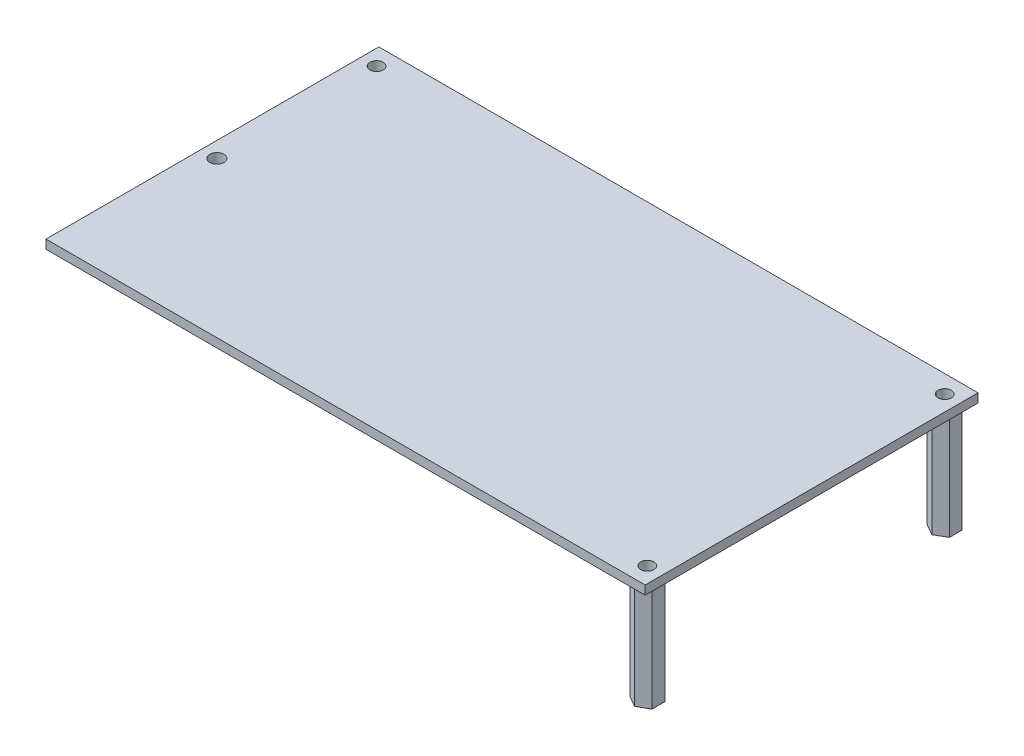
ISO-10303-21;
HEADER;
FILE_DESCRIPTION(('STEP AP214'),'2;1');
FILE_NAME('part.step','',(''),(''),'','','');
FILE_SCHEMA(('AUTOMOTIVE_DESIGN { 1 0 10303 214 1 1 1 1 }'));
ENDSEC;
DATA;
#1=APPLICATION_CONTEXT('core data for automotive mechanical design processes');
#2=APPLICATION_PROTOCOL_DEFINITION('international standard','automotive_design',2000,#1);
#3=PRODUCT_CONTEXT('',#1,'mechanical');
#4=PRODUCT('Part','Part','',(#3));
#5=PRODUCT_RELATED_PRODUCT_CATEGORY('part','',(#4));
#6=PRODUCT_DEFINITION_FORMATION('','',#4);
#7=PRODUCT_DEFINITION_CONTEXT('part definition',#1,'design');
#8=PRODUCT_DEFINITION('design','',#6,#7);
#9=PRODUCT_DEFINITION_SHAPE('','',#8);
#10=(LENGTH_UNIT() NAMED_UNIT(*) SI_UNIT(.MILLI.,.METRE.));
#11=(NAMED_UNIT(*) PLANE_ANGLE_UNIT() SI_UNIT($,.RADIAN.));
#12=(NAMED_UNIT(*) SI_UNIT($,.STERADIAN.) SOLID_ANGLE_UNIT());
#13=UNCERTAINTY_MEASURE_WITH_UNIT(LENGTH_MEASURE(1.E-05),#10,'distance_accuracy_value','');
#14=(GEOMETRIC_REPRESENTATION_CONTEXT(3) GLOBAL_UNCERTAINTY_ASSIGNED_CONTEXT((#13)) GLOBAL_UNIT_ASSIGNED_CONTEXT((#10,
#11,#12)) REPRESENTATION_CONTEXT('',''));
#15=CARTESIAN_POINT('',(0.,0.,0.));
#16=DIRECTION('',(0.,0.,1.));
#17=DIRECTION('',(1.,0.,0.));
#18=AXIS2_PLACEMENT_3D('',#15,#16,#17);
#19=CARTESIAN_POINT('',(0.,0.,0.));
#20=DIRECTION('',(0.,-1.,0.));
#21=DIRECTION('',(0.,0.,-1.));
#22=AXIS2_PLACEMENT_3D('',#19,#20,#21);
#23=PLANE('',#22);
#24=DIRECTION('',(0.866025403784531,0.,0.499999999999841));
#25=VECTOR('',#24,1.);
#26=CARTESIAN_POINT('',(131.5,0.,-6.88675134594749));
#27=LINE('',#26,#25);
#28=CARTESIAN_POINT('',(131.5,0.,-6.88675134594749));
#29=VERTEX_POINT('',#28);
#30=CARTESIAN_POINT('',(134.,0.,-5.44337567297402));
#31=VERTEX_POINT('',#30);
#32=EDGE_CURVE('E249',#29,#31,#27,.T.);
#33=ORIENTED_EDGE('',*,*,#32,.F.);
#34=DIRECTION('',(0.866025403784541,0.,-0.499999999999823));
#35=VECTOR('',#34,1.);
#36=CARTESIAN_POINT('',(129.,0.,-5.4433756729741));
#37=LINE('',#36,#35);
#38=CARTESIAN_POINT('',(129.,0.,-5.4433756729741));
#39=VERTEX_POINT('',#38);
#40=EDGE_CURVE('E246',#39,#29,#37,.T.);
#41=ORIENTED_EDGE('',*,*,#40,.F.);
#42=DIRECTION('',(0.,0.,-1.));
#43=VECTOR('',#42,1.);
#44=CARTESIAN_POINT('',(129.,0.,-2.55662432702534));
#45=LINE('',#44,#43);
#46=CARTESIAN_POINT('',(129.,0.,-2.55662432702534));
#47=VERTEX_POINT('',#46);
#48=EDGE_CURVE('E259',#47,#39,#45,.T.);
#49=ORIENTED_EDGE('',*,*,#48,.F.);
#50=DIRECTION('',(-0.866025403784436,0.,-0.500000000000004));
#51=VECTOR('',#50,1.);
#52=CARTESIAN_POINT('',(131.5,0.,-1.11324865405125));
#53=LINE('',#52,#51);
#54=CARTESIAN_POINT('',(131.5,0.,-1.11324865405125));
#55=VERTEX_POINT('',#54);
#56=EDGE_CURVE('E275',#55,#47,#53,.T.);
#57=ORIENTED_EDGE('',*,*,#56,.F.);
#58=DIRECTION('',(-0.866025403784441,0.,0.499999999999995));
#59=VECTOR('',#58,1.);
#60=CARTESIAN_POINT('',(134.,0.,-2.55662432702529));
#61=LINE('',#60,#59);
#62=CARTESIAN_POINT('',(134.,0.,-2.55662432702529));
#63=VERTEX_POINT('',#62);
#64=EDGE_CURVE('E273',#63,#55,#61,.T.);
#65=ORIENTED_EDGE('',*,*,#64,.F.);
#66=DIRECTION('',(0.,0.,1.));
#67=VECTOR('',#66,1.);
#68=CARTESIAN_POINT('',(134.,0.,-5.44337567297402));
#69=LINE('',#68,#67);
#70=EDGE_CURVE('E271',#31,#63,#69,.T.);
#71=ORIENTED_EDGE('',*,*,#70,.F.);
#72=EDGE_LOOP('',(#33,#41,#49,#57,#65,#71));
#73=FACE_BOUND('',#72,.T.);
#74=DIRECTION('',(0.866025403784439,0.,0.499999999999999));
#75=VECTOR('',#74,1.);
#76=CARTESIAN_POINT('',(3.50000000000001,0.,-37.8867513459481));
#77=LINE('',#76,#75);
#78=CARTESIAN_POINT('',(3.50000000000001,0.,-37.8867513459481));
#79=VERTEX_POINT('',#78);
#80=CARTESIAN_POINT('',(6.00000000000001,0.,-36.4433756729741));
#81=VERTEX_POINT('',#80);
#82=EDGE_CURVE('E353',#79,#81,#77,.T.);
#83=ORIENTED_EDGE('',*,*,#82,.F.);
#84=DIRECTION('',(0.866025403784438,0.,-0.500000000000002));
#85=VECTOR('',#84,1.);
#86=CARTESIAN_POINT('',(1.00000000000001,0.,-36.4433756729741));
#87=LINE('',#86,#85);
#88=CARTESIAN_POINT('',(1.00000000000001,0.,-36.4433756729741));
#89=VERTEX_POINT('',#88);
#90=EDGE_CURVE('E335',#89,#79,#87,.T.);
#91=ORIENTED_EDGE('',*,*,#90,.F.);
#92=DIRECTION('',(0.,0.,-1.));
#93=VECTOR('',#92,1.);
#94=CARTESIAN_POINT('',(1.00000000000001,0.,-33.5566243270259));
#95=LINE('',#94,#93);
#96=CARTESIAN_POINT('',(1.00000000000001,0.,-33.5566243270259));
#97=VERTEX_POINT('',#96);
#98=EDGE_CURVE('E340',#97,#89,#95,.T.);
#99=ORIENTED_EDGE('',*,*,#98,.F.);
#100=DIRECTION('',(-0.86602540378444,0.,-0.499999999999998));
#101=VECTOR('',#100,1.);
#102=CARTESIAN_POINT('',(3.50000000000001,0.,-32.1132486540519));
#103=LINE('',#102,#101);
#104=CARTESIAN_POINT('',(3.50000000000001,0.,-32.1132486540519));
#105=VERTEX_POINT('',#104);
#106=EDGE_CURVE('E359',#105,#97,#103,.T.);
#107=ORIENTED_EDGE('',*,*,#106,.F.);
#108=DIRECTION('',(-0.866025403784439,0.,0.5));
#109=VECTOR('',#108,1.);
#110=CARTESIAN_POINT('',(6.00000000000001,0.,-33.5566243270259));
#111=LINE('',#110,#109);
#112=CARTESIAN_POINT('',(6.00000000000001,0.,-33.5566243270259));
#113=VERTEX_POINT('',#112);
#114=EDGE_CURVE('E357',#113,#105,#111,.T.);
#115=ORIENTED_EDGE('',*,*,#114,.F.);
#116=DIRECTION('',(0.,0.,1.));
#117=VECTOR('',#116,1.);
#118=CARTESIAN_POINT('',(6.00000000000001,0.,-36.4433756729741));
#119=LINE('',#118,#117);
#120=EDGE_CURVE('E355',#81,#113,#119,.T.);
#121=ORIENTED_EDGE('',*,*,#120,.F.);
#122=EDGE_LOOP('',(#83,#91,#99,#107,#115,#121));
#123=FACE_BOUND('',#122,.T.);
#124=DIRECTION('',(0.,0.,1.));
#125=VECTOR('',#124,1.);
#126=CARTESIAN_POINT('',(0.,0.,0.));
#127=LINE('',#126,#125);
#128=CARTESIAN_POINT('',(0.,0.,-75.));
#129=VERTEX_POINT('',#128);
#130=CARTESIAN_POINT('',(0.,0.,0.));
#131=VERTEX_POINT('',#130);
#132=EDGE_CURVE('E390',#129,#131,#127,.T.);
#133=ORIENTED_EDGE('',*,*,#132,.F.);
#134=DIRECTION('',(-1.,0.,0.));
#135=VECTOR('',#134,1.);
#136=CARTESIAN_POINT('',(0.,0.,-75.));
#137=LINE('',#136,#135);
#138=CARTESIAN_POINT('',(135.,0.,-75.));
#139=VERTEX_POINT('',#138);
#140=EDGE_CURVE('E395',#139,#129,#137,.T.);
#141=ORIENTED_EDGE('',*,*,#140,.F.);
#142=DIRECTION('',(0.,0.,-1.));
#143=VECTOR('',#142,1.);
#144=CARTESIAN_POINT('',(135.,0.,0.));
#145=LINE('',#144,#143);
#146=CARTESIAN_POINT('',(135.,0.,0.));
#147=VERTEX_POINT('',#146);
#148=EDGE_CURVE('E406',#147,#139,#145,.T.);
#149=ORIENTED_EDGE('',*,*,#148,.F.);
#150=DIRECTION('',(1.,0.,0.));
#151=VECTOR('',#150,1.);
#152=CARTESIAN_POINT('',(0.,0.,0.));
#153=LINE('',#152,#151);
#154=EDGE_CURVE('E404',#131,#147,#153,.T.);
#155=ORIENTED_EDGE('',*,*,#154,.F.);
#156=EDGE_LOOP('',(#133,#141,#149,#155));
#157=FACE_BOUND('',#156,.T.);
#158=DIRECTION('',(0.866025403784439,0.,0.5));
#159=VECTOR('',#158,1.);
#160=CARTESIAN_POINT('',(3.5,0.,-73.8867513459482));
#161=LINE('',#160,#159);
#162=CARTESIAN_POINT('',(3.5,0.,-73.8867513459482));
#163=VERTEX_POINT('',#162);
#164=CARTESIAN_POINT('',(6.00000000000002,0.,-72.4433756729741));
#165=VERTEX_POINT('',#164);
#166=EDGE_CURVE('E310',#163,#165,#161,.T.);
#167=ORIENTED_EDGE('',*,*,#166,.F.);
#168=DIRECTION('',(0.866025403784429,0.,-0.500000000000017));
#169=VECTOR('',#168,1.);
#170=CARTESIAN_POINT('',(1.00000000000002,0.,-72.4433756729741));
#171=LINE('',#170,#169);
#172=CARTESIAN_POINT('',(1.00000000000002,0.,-72.4433756729741));
#173=VERTEX_POINT('',#172);
#174=EDGE_CURVE('E292',#173,#163,#171,.T.);
#175=ORIENTED_EDGE('',*,*,#174,.F.);
#176=DIRECTION('',(0.,0.,-1.));
#177=VECTOR('',#176,1.);
#178=CARTESIAN_POINT('',(1.00000000000002,0.,-69.5566243270259));
#179=LINE('',#178,#177);
#180=CARTESIAN_POINT('',(1.00000000000002,0.,-69.5566243270259));
#181=VERTEX_POINT('',#180);
#182=EDGE_CURVE('E297',#181,#173,#179,.T.);
#183=ORIENTED_EDGE('',*,*,#182,.F.);
#184=DIRECTION('',(-0.866025403784439,0.,-0.499999999999999));
#185=VECTOR('',#184,1.);
#186=CARTESIAN_POINT('',(3.5,0.,-68.1132486540519));
#187=LINE('',#186,#185);
#188=CARTESIAN_POINT('',(3.5,0.,-68.1132486540519));
#189=VERTEX_POINT('',#188);
#190=EDGE_CURVE('E316',#189,#181,#187,.T.);
#191=ORIENTED_EDGE('',*,*,#190,.F.);
#192=DIRECTION('',(-0.866025403784439,0.,0.5));
#193=VECTOR('',#192,1.);
#194=CARTESIAN_POINT('',(6.00000000000002,0.,-69.5566243270259));
#195=LINE('',#194,#193);
#196=CARTESIAN_POINT('',(6.00000000000002,0.,-69.5566243270259));
#197=VERTEX_POINT('',#196);
#198=EDGE_CURVE('E314',#197,#189,#195,.T.);
#199=ORIENTED_EDGE('',*,*,#198,.F.);
#200=DIRECTION('',(0.,0.,1.));
#201=VECTOR('',#200,1.);
#202=CARTESIAN_POINT('',(6.00000000000002,0.,-72.4433756729741));
#203=LINE('',#202,#201);
#204=EDGE_CURVE('E312',#165,#197,#203,.T.);
#205=ORIENTED_EDGE('',*,*,#204,.F.);
#206=EDGE_LOOP('',(#167,#175,#183,#191,#199,#205));
#207=FACE_BOUND('',#206,.T.);
#208=DIRECTION('',(0.866025403784437,0.,-0.500000000000003));
#209=VECTOR('',#208,1.);
#210=CARTESIAN_POINT('',(129.,0.,-72.4433756729741));
#211=LINE('',#210,#209);
#212=CARTESIAN_POINT('',(129.,0.,-72.4433756729741));
#213=VERTEX_POINT('',#212);
#214=CARTESIAN_POINT('',(131.5,0.,-73.8867513459481));
#215=VERTEX_POINT('',#214);
#216=EDGE_CURVE('E604',#213,#215,#211,.T.);
#217=ORIENTED_EDGE('',*,*,#216,.F.);
#218=DIRECTION('',(0.,0.,-1.));
#219=VECTOR('',#218,1.);
#220=CARTESIAN_POINT('',(129.,0.,-69.556624327026));
#221=LINE('',#220,#219);
#222=CARTESIAN_POINT('',(129.,0.,-69.556624327026));
#223=VERTEX_POINT('',#222);
#224=EDGE_CURVE('E244',#223,#213,#221,.T.);
#225=ORIENTED_EDGE('',*,*,#224,.F.);
#226=DIRECTION('',(-0.866025403784437,0.,-0.500000000000003));
#227=VECTOR('',#226,1.);
#228=CARTESIAN_POINT('',(131.5,0.,-68.1132486540519));
#229=LINE('',#228,#227);
#230=CARTESIAN_POINT('',(131.5,0.,-68.1132486540519));
#231=VERTEX_POINT('',#230);
#232=EDGE_CURVE('E240',#231,#223,#229,.T.);
#233=ORIENTED_EDGE('',*,*,#232,.F.);
#234=DIRECTION('',(-0.866025403784431,0.,0.500000000000014));
#235=VECTOR('',#234,1.);
#236=CARTESIAN_POINT('',(134.,0.,-69.556624327026));
#237=LINE('',#236,#235);
#238=CARTESIAN_POINT('',(134.,0.,-69.556624327026));
#239=VERTEX_POINT('',#238);
#240=EDGE_CURVE('E610',#239,#231,#237,.T.);
#241=ORIENTED_EDGE('',*,*,#240,.F.);
#242=DIRECTION('',(0.,0.,1.));
#243=VECTOR('',#242,1.);
#244=CARTESIAN_POINT('',(134.,0.,-72.443375672974));
#245=LINE('',#244,#243);
#246=CARTESIAN_POINT('',(134.,0.,-72.443375672974));
#247=VERTEX_POINT('',#246);
#248=EDGE_CURVE('E608',#247,#239,#245,.T.);
#249=ORIENTED_EDGE('',*,*,#248,.F.);
#250=DIRECTION('',(0.866025403784437,0.,0.500000000000003));
#251=VECTOR('',#250,1.);
#252=CARTESIAN_POINT('',(131.5,0.,-73.8867513459481));
#253=LINE('',#252,#251);
#254=EDGE_CURVE('E606',#215,#247,#253,.T.);
#255=ORIENTED_EDGE('',*,*,#254,.F.);
#256=EDGE_LOOP('',(#217,#225,#233,#241,#249,#255));
#257=FACE_BOUND('',#256,.T.);
#258=ADVANCED_FACE('F35',(#73,#123,#157,#207,#257),#23,.T.);
#259=CARTESIAN_POINT('',(0.,2.,0.));
#260=DIRECTION('',(0.,-1.,0.));
#261=DIRECTION('',(0.,0.,-1.));
#262=AXIS2_PLACEMENT_3D('',#259,#260,#261);
#263=PLANE('',#262);
#264=DIRECTION('',(0.,0.,1.));
#265=VECTOR('',#264,1.);
#266=CARTESIAN_POINT('',(0.,2.,0.));
#267=LINE('',#266,#265);
#268=CARTESIAN_POINT('',(0.,2.,-75.));
#269=VERTEX_POINT('',#268);
#270=CARTESIAN_POINT('',(0.,2.,0.));
#271=VERTEX_POINT('',#270);
#272=EDGE_CURVE('E391',#269,#271,#267,.T.);
#273=ORIENTED_EDGE('',*,*,#272,.T.);
#274=DIRECTION('',(1.,0.,0.));
#275=VECTOR('',#274,1.);
#276=CARTESIAN_POINT('',(0.,2.,0.));
#277=LINE('',#276,#275);
#278=CARTESIAN_POINT('',(135.,2.,0.));
#279=VERTEX_POINT('',#278);
#280=EDGE_CURVE('E394',#271,#279,#277,.T.);
#281=ORIENTED_EDGE('',*,*,#280,.T.);
#282=DIRECTION('',(0.,0.,-1.));
#283=VECTOR('',#282,1.);
#284=CARTESIAN_POINT('',(135.,2.,0.));
#285=LINE('',#284,#283);
#286=CARTESIAN_POINT('',(135.,2.,-75.));
#287=VERTEX_POINT('',#286);
#288=EDGE_CURVE('E397',#279,#287,#285,.T.);
#289=ORIENTED_EDGE('',*,*,#288,.T.);
#290=DIRECTION('',(-1.,0.,0.));
#291=VECTOR('',#290,1.);
#292=CARTESIAN_POINT('',(0.,2.,-75.));
#293=LINE('',#292,#291);
#294=EDGE_CURVE('E399',#287,#269,#293,.T.);
#295=ORIENTED_EDGE('',*,*,#294,.T.);
#296=EDGE_LOOP('',(#273,#281,#289,#295));
#297=FACE_BOUND('',#296,.T.);
#298=CARTESIAN_POINT('',(3.5,2.,-71.));
#299=DIRECTION('',(0.,1.,0.));
#300=DIRECTION('',(0.,0.,1.));
#301=AXIS2_PLACEMENT_3D('',#298,#299,#300);
#302=CIRCLE('',#301,1.5);
#303=CARTESIAN_POINT('',(3.5,2.,-69.5));
#304=VERTEX_POINT('',#303);
#305=EDGE_CURVE('E387',#304,#304,#302,.T.);
#306=ORIENTED_EDGE('',*,*,#305,.F.);
#307=EDGE_LOOP('',(#306));
#308=FACE_BOUND('',#307,.T.);
#309=CARTESIAN_POINT('',(131.5,2.,-71.));
#310=DIRECTION('',(0.,1.,0.));
#311=DIRECTION('',(0.,0.,1.));
#312=AXIS2_PLACEMENT_3D('',#309,#310,#311);
#313=CIRCLE('',#312,1.5);
#314=CARTESIAN_POINT('',(131.5,2.,-69.5));
#315=VERTEX_POINT('',#314);
#316=EDGE_CURVE('E384',#315,#315,#313,.T.);
#317=ORIENTED_EDGE('',*,*,#316,.F.);
#318=EDGE_LOOP('',(#317));
#319=FACE_BOUND('',#318,.T.);
#320=CARTESIAN_POINT('',(131.5,2.,-3.99999999999999));
#321=DIRECTION('',(0.,1.,0.));
#322=DIRECTION('',(0.,0.,1.));
#323=AXIS2_PLACEMENT_3D('',#320,#321,#322);
#324=CIRCLE('',#323,1.5);
#325=CARTESIAN_POINT('',(131.5,2.,-2.49999999999999));
#326=VERTEX_POINT('',#325);
#327=EDGE_CURVE('E381',#326,#326,#324,.T.);
#328=ORIENTED_EDGE('',*,*,#327,.F.);
#329=EDGE_LOOP('',(#328));
#330=FACE_BOUND('',#329,.T.);
#331=CARTESIAN_POINT('',(3.50000000000001,2.,-35.));
#332=DIRECTION('',(0.,1.,0.));
#333=DIRECTION('',(0.,0.,1.));
#334=AXIS2_PLACEMENT_3D('',#331,#332,#333);
#335=CIRCLE('',#334,1.6);
#336=CARTESIAN_POINT('',(3.50000000000001,2.,-33.4));
#337=VERTEX_POINT('',#336);
#338=EDGE_CURVE('E378',#337,#337,#335,.T.);
#339=ORIENTED_EDGE('',*,*,#338,.F.);
#340=EDGE_LOOP('',(#339));
#341=FACE_BOUND('',#340,.T.);
#342=ADVANCED_FACE('F433',(#297,#308,#319,#330,#341),#263,.F.);
#343=CARTESIAN_POINT('',(0.,2.,0.));
#344=DIRECTION('',(1.,0.,0.));
#345=DIRECTION('',(0.,0.,-1.));
#346=AXIS2_PLACEMENT_3D('',#343,#344,#345);
#347=PLANE('',#346);
#348=ORIENTED_EDGE('',*,*,#132,.T.);
#349=DIRECTION('',(0.,-1.,0.));
#350=VECTOR('',#349,1.);
#351=CARTESIAN_POINT('',(0.,2.,0.));
#352=LINE('',#351,#350);
#353=EDGE_CURVE('E11',#271,#131,#352,.T.);
#354=ORIENTED_EDGE('',*,*,#353,.F.);
#355=ORIENTED_EDGE('',*,*,#272,.F.);
#356=DIRECTION('',(0.,-1.,0.));
#357=VECTOR('',#356,1.);
#358=CARTESIAN_POINT('',(0.,2.,-75.));
#359=LINE('',#358,#357);
#360=EDGE_CURVE('E401',#269,#129,#359,.T.);
#361=ORIENTED_EDGE('',*,*,#360,.T.);
#362=EDGE_LOOP('',(#348,#354,#355,#361));
#363=FACE_BOUND('',#362,.T.);
#364=ADVANCED_FACE('F37',(#363),#347,.F.);
#365=CARTESIAN_POINT('',(0.,2.,0.));
#366=DIRECTION('',(0.,0.,-1.));
#367=DIRECTION('',(-1.,0.,0.));
#368=AXIS2_PLACEMENT_3D('',#365,#366,#367);
#369=PLANE('',#368);
#370=ORIENTED_EDGE('',*,*,#154,.T.);
#371=DIRECTION('',(0.,-1.,0.));
#372=VECTOR('',#371,1.);
#373=CARTESIAN_POINT('',(135.,2.,0.));
#374=LINE('',#373,#372);
#375=EDGE_CURVE('E43',#279,#147,#374,.T.);
#376=ORIENTED_EDGE('',*,*,#375,.F.);
#377=ORIENTED_EDGE('',*,*,#280,.F.);
#378=ORIENTED_EDGE('',*,*,#353,.T.);
#379=EDGE_LOOP('',(#370,#376,#377,#378));
#380=FACE_BOUND('',#379,.T.);
#381=ADVANCED_FACE('F435',(#380),#369,.F.);
#382=CARTESIAN_POINT('',(135.,2.,0.));
#383=DIRECTION('',(-1.,0.,0.));
#384=DIRECTION('',(0.,0.,1.));
#385=AXIS2_PLACEMENT_3D('',#382,#383,#384);
#386=PLANE('',#385);
#387=ORIENTED_EDGE('',*,*,#148,.T.);
#388=DIRECTION('',(0.,-1.,0.));
#389=VECTOR('',#388,1.);
#390=CARTESIAN_POINT('',(135.,2.,-75.));
#391=LINE('',#390,#389);
#392=EDGE_CURVE('E411',#287,#139,#391,.T.);
#393=ORIENTED_EDGE('',*,*,#392,.F.);
#394=ORIENTED_EDGE('',*,*,#288,.F.);
#395=ORIENTED_EDGE('',*,*,#375,.T.);
#396=EDGE_LOOP('',(#387,#393,#394,#395));
#397=FACE_BOUND('',#396,.T.);
#398=ADVANCED_FACE('F418',(#397),#386,.F.);
#399=CARTESIAN_POINT('',(0.,2.,-75.));
#400=DIRECTION('',(0.,0.,1.));
#401=DIRECTION('',(1.,0.,0.));
#402=AXIS2_PLACEMENT_3D('',#399,#400,#401);
#403=PLANE('',#402);
#404=ORIENTED_EDGE('',*,*,#140,.T.);
#405=ORIENTED_EDGE('',*,*,#360,.F.);
#406=ORIENTED_EDGE('',*,*,#294,.F.);
#407=ORIENTED_EDGE('',*,*,#392,.T.);
#408=EDGE_LOOP('',(#404,#405,#406,#407));
#409=FACE_BOUND('',#408,.T.);
#410=ADVANCED_FACE('F427',(#409),#403,.F.);
#411=CARTESIAN_POINT('',(3.5,2.,-71.));
#412=DIRECTION('',(0.,-1.,0.));
#413=DIRECTION('',(0.,0.,-1.));
#414=AXIS2_PLACEMENT_3D('',#411,#412,#413);
#415=CYLINDRICAL_SURFACE('',#414,1.5);
#416=ORIENTED_EDGE('',*,*,#305,.T.);
#417=EDGE_LOOP('',(#416));
#418=FACE_BOUND('',#417,.T.);
#419=CARTESIAN_POINT('',(3.5,-24.,-71.));
#420=DIRECTION('',(0.,1.,0.));
#421=DIRECTION('',(0.,0.,1.));
#422=AXIS2_PLACEMENT_3D('',#419,#420,#421);
#423=CIRCLE('',#422,1.5);
#424=CARTESIAN_POINT('',(3.5,-24.,-69.5));
#425=VERTEX_POINT('',#424);
#426=EDGE_CURVE('E593',#425,#425,#423,.T.);
#427=ORIENTED_EDGE('',*,*,#426,.F.);
#428=EDGE_LOOP('',(#427));
#429=FACE_BOUND('',#428,.T.);
#430=ADVANCED_FACE('F454',(#418,#429),#415,.F.);
#431=CARTESIAN_POINT('',(131.5,2.,-71.));
#432=DIRECTION('',(0.,-1.,0.));
#433=DIRECTION('',(0.,0.,-1.));
#434=AXIS2_PLACEMENT_3D('',#431,#432,#433);
#435=CYLINDRICAL_SURFACE('',#434,1.5);
#436=ORIENTED_EDGE('',*,*,#316,.T.);
#437=EDGE_LOOP('',(#436));
#438=FACE_BOUND('',#437,.T.);
#439=CARTESIAN_POINT('',(131.5,-24.,-71.));
#440=DIRECTION('',(0.,1.,0.));
#441=DIRECTION('',(0.,0.,1.));
#442=AXIS2_PLACEMENT_3D('',#439,#440,#441);
#443=CIRCLE('',#442,1.5);
#444=CARTESIAN_POINT('',(131.5,-24.,-69.5));
#445=VERTEX_POINT('',#444);
#446=EDGE_CURVE('E583',#445,#445,#443,.T.);
#447=ORIENTED_EDGE('',*,*,#446,.F.);
#448=EDGE_LOOP('',(#447));
#449=FACE_BOUND('',#448,.T.);
#450=ADVANCED_FACE('F458',(#438,#449),#435,.F.);
#451=CARTESIAN_POINT('',(131.5,2.,-3.99999999999999));
#452=DIRECTION('',(0.,-1.,0.));
#453=DIRECTION('',(0.,0.,-1.));
#454=AXIS2_PLACEMENT_3D('',#451,#452,#453);
#455=CYLINDRICAL_SURFACE('',#454,1.5);
#456=ORIENTED_EDGE('',*,*,#327,.T.);
#457=EDGE_LOOP('',(#456));
#458=FACE_BOUND('',#457,.T.);
#459=CARTESIAN_POINT('',(131.5,-24.,-3.99999999999999));
#460=DIRECTION('',(0.,1.,0.));
#461=DIRECTION('',(0.,0.,1.));
#462=AXIS2_PLACEMENT_3D('',#459,#460,#461);
#463=CIRCLE('',#462,1.5);
#464=CARTESIAN_POINT('',(131.5,-24.,-2.49999999999999));
#465=VERTEX_POINT('',#464);
#466=EDGE_CURVE('E585',#465,#465,#463,.T.);
#467=ORIENTED_EDGE('',*,*,#466,.F.);
#468=EDGE_LOOP('',(#467));
#469=FACE_BOUND('',#468,.T.);
#470=ADVANCED_FACE('F463',(#458,#469),#455,.F.);
#471=CARTESIAN_POINT('',(3.50000000000001,2.,-35.));
#472=DIRECTION('',(0.,-1.,0.));
#473=DIRECTION('',(0.,0.,-1.));
#474=AXIS2_PLACEMENT_3D('',#471,#472,#473);
#475=CYLINDRICAL_SURFACE('',#474,1.6);
#476=ORIENTED_EDGE('',*,*,#338,.T.);
#477=EDGE_LOOP('',(#476));
#478=FACE_BOUND('',#477,.T.);
#479=CARTESIAN_POINT('',(3.50000000000001,-24.,-35.));
#480=DIRECTION('',(0.,1.,0.));
#481=DIRECTION('',(0.,0.,1.));
#482=AXIS2_PLACEMENT_3D('',#479,#480,#481);
#483=CIRCLE('',#482,1.6);
#484=CARTESIAN_POINT('',(3.50000000000001,-24.,-33.4));
#485=VERTEX_POINT('',#484);
#486=EDGE_CURVE('E588',#485,#485,#483,.T.);
#487=ORIENTED_EDGE('',*,*,#486,.F.);
#488=EDGE_LOOP('',(#487));
#489=FACE_BOUND('',#488,.T.);
#490=ADVANCED_FACE('F470',(#478,#489),#475,.F.);
#491=CARTESIAN_POINT('',(1.00000000000001,-24.,-36.4433756729741));
#492=DIRECTION('',(0.500000000000001,0.,0.866025403784438));
#493=DIRECTION('',(0.866025403784438,0.,-0.500000000000002));
#494=AXIS2_PLACEMENT_3D('',#491,#492,#493);
#495=PLANE('',#494);
#496=ORIENTED_EDGE('',*,*,#90,.T.);
#497=DIRECTION('',(0.,1.,0.));
#498=VECTOR('',#497,1.);
#499=CARTESIAN_POINT('',(3.50000000000001,-24.,-37.8867513459481));
#500=LINE('',#499,#498);
#501=CARTESIAN_POINT('',(3.50000000000001,-24.,-37.8867513459481));
#502=VERTEX_POINT('',#501);
#503=EDGE_CURVE('E376',#502,#79,#500,.T.);
#504=ORIENTED_EDGE('',*,*,#503,.F.);
#505=DIRECTION('',(0.866025403784438,0.,-0.500000000000002));
#506=VECTOR('',#505,1.);
#507=CARTESIAN_POINT('',(1.00000000000001,-24.,-36.4433756729741));
#508=LINE('',#507,#506);
#509=CARTESIAN_POINT('',(1.00000000000001,-24.,-36.4433756729741));
#510=VERTEX_POINT('',#509);
#511=EDGE_CURVE('E336',#510,#502,#508,.T.);
#512=ORIENTED_EDGE('',*,*,#511,.F.);
#513=DIRECTION('',(0.,1.,0.));
#514=VECTOR('',#513,1.);
#515=CARTESIAN_POINT('',(1.00000000000001,-24.,-36.4433756729741));
#516=LINE('',#515,#514);
#517=EDGE_CURVE('E350',#510,#89,#516,.T.);
#518=ORIENTED_EDGE('',*,*,#517,.T.);
#519=EDGE_LOOP('',(#496,#504,#512,#518));
#520=FACE_BOUND('',#519,.T.);
#521=ADVANCED_FACE('F474',(#520),#495,.F.);
#522=CARTESIAN_POINT('',(3.50000000000001,-24.,-37.8867513459481));
#523=DIRECTION('',(-0.499999999999999,0.,0.866025403784439));
#524=DIRECTION('',(0.866025403784439,0.,0.499999999999999));
#525=AXIS2_PLACEMENT_3D('',#522,#523,#524);
#526=PLANE('',#525);
#527=ORIENTED_EDGE('',*,*,#82,.T.);
#528=DIRECTION('',(0.,1.,0.));
#529=VECTOR('',#528,1.);
#530=CARTESIAN_POINT('',(6.00000000000001,-24.,-36.4433756729741));
#531=LINE('',#530,#529);
#532=CARTESIAN_POINT('',(6.00000000000001,-24.,-36.4433756729741));
#533=VERTEX_POINT('',#532);
#534=EDGE_CURVE('E373',#533,#81,#531,.T.);
#535=ORIENTED_EDGE('',*,*,#534,.F.);
#536=DIRECTION('',(0.866025403784439,0.,0.499999999999999));
#537=VECTOR('',#536,1.);
#538=CARTESIAN_POINT('',(3.50000000000001,-24.,-37.8867513459481));
#539=LINE('',#538,#537);
#540=EDGE_CURVE('E339',#502,#533,#539,.T.);
#541=ORIENTED_EDGE('',*,*,#540,.F.);
#542=ORIENTED_EDGE('',*,*,#503,.T.);
#543=EDGE_LOOP('',(#527,#535,#541,#542));
#544=FACE_BOUND('',#543,.T.);
#545=ADVANCED_FACE('F478',(#544),#526,.F.);
#546=CARTESIAN_POINT('',(6.00000000000001,-24.,-36.4433756729741));
#547=DIRECTION('',(-1.,0.,0.));
#548=DIRECTION('',(0.,0.,1.));
#549=AXIS2_PLACEMENT_3D('',#546,#547,#548);
#550=PLANE('',#549);
#551=ORIENTED_EDGE('',*,*,#120,.T.);
#552=DIRECTION('',(0.,1.,0.));
#553=VECTOR('',#552,1.);
#554=CARTESIAN_POINT('',(6.00000000000001,-24.,-33.5566243270259));
#555=LINE('',#554,#553);
#556=CARTESIAN_POINT('',(6.00000000000001,-24.,-33.5566243270259));
#557=VERTEX_POINT('',#556);
#558=EDGE_CURVE('E370',#557,#113,#555,.T.);
#559=ORIENTED_EDGE('',*,*,#558,.F.);
#560=DIRECTION('',(0.,0.,1.));
#561=VECTOR('',#560,1.);
#562=CARTESIAN_POINT('',(6.00000000000001,-24.,-36.4433756729741));
#563=LINE('',#562,#561);
#564=EDGE_CURVE('E342',#533,#557,#563,.T.);
#565=ORIENTED_EDGE('',*,*,#564,.F.);
#566=ORIENTED_EDGE('',*,*,#534,.T.);
#567=EDGE_LOOP('',(#551,#559,#565,#566));
#568=FACE_BOUND('',#567,.T.);
#569=ADVANCED_FACE('F482',(#568),#550,.F.);
#570=CARTESIAN_POINT('',(6.00000000000001,-24.,-33.5566243270259));
#571=DIRECTION('',(-0.5,0.,-0.866025403784439));
#572=DIRECTION('',(-0.866025403784439,0.,0.5));
#573=AXIS2_PLACEMENT_3D('',#570,#571,#572);
#574=PLANE('',#573);
#575=ORIENTED_EDGE('',*,*,#114,.T.);
#576=DIRECTION('',(0.,1.,0.));
#577=VECTOR('',#576,1.);
#578=CARTESIAN_POINT('',(3.50000000000001,-24.,-32.1132486540519));
#579=LINE('',#578,#577);
#580=CARTESIAN_POINT('',(3.50000000000001,-24.,-32.1132486540519));
#581=VERTEX_POINT('',#580);
#582=EDGE_CURVE('E367',#581,#105,#579,.T.);
#583=ORIENTED_EDGE('',*,*,#582,.F.);
#584=DIRECTION('',(-0.866025403784439,0.,0.5));
#585=VECTOR('',#584,1.);
#586=CARTESIAN_POINT('',(6.00000000000001,-24.,-33.5566243270259));
#587=LINE('',#586,#585);
#588=EDGE_CURVE('E344',#557,#581,#587,.T.);
#589=ORIENTED_EDGE('',*,*,#588,.F.);
#590=ORIENTED_EDGE('',*,*,#558,.T.);
#591=EDGE_LOOP('',(#575,#583,#589,#590));
#592=FACE_BOUND('',#591,.T.);
#593=ADVANCED_FACE('F486',(#592),#574,.F.);
#594=CARTESIAN_POINT('',(3.50000000000001,-24.,-32.1132486540519));
#595=DIRECTION('',(0.499999999999998,0.,-0.86602540378444));
#596=DIRECTION('',(-0.86602540378444,0.,-0.499999999999998));
#597=AXIS2_PLACEMENT_3D('',#594,#595,#596);
#598=PLANE('',#597);
#599=ORIENTED_EDGE('',*,*,#106,.T.);
#600=DIRECTION('',(0.,1.,0.));
#601=VECTOR('',#600,1.);
#602=CARTESIAN_POINT('',(1.00000000000001,-24.,-33.5566243270259));
#603=LINE('',#602,#601);
#604=CARTESIAN_POINT('',(1.00000000000001,-24.,-33.5566243270259));
#605=VERTEX_POINT('',#604);
#606=EDGE_CURVE('E365',#605,#97,#603,.T.);
#607=ORIENTED_EDGE('',*,*,#606,.F.);
#608=DIRECTION('',(-0.86602540378444,0.,-0.499999999999998));
#609=VECTOR('',#608,1.);
#610=CARTESIAN_POINT('',(3.50000000000001,-24.,-32.1132486540519));
#611=LINE('',#610,#609);
#612=EDGE_CURVE('E346',#581,#605,#611,.T.);
#613=ORIENTED_EDGE('',*,*,#612,.F.);
#614=ORIENTED_EDGE('',*,*,#582,.T.);
#615=EDGE_LOOP('',(#599,#607,#613,#614));
#616=FACE_BOUND('',#615,.T.);
#617=ADVANCED_FACE('F490',(#616),#598,.F.);
#618=CARTESIAN_POINT('',(1.00000000000001,-24.,-33.5566243270259));
#619=DIRECTION('',(1.,0.,0.));
#620=DIRECTION('',(0.,0.,-1.));
#621=AXIS2_PLACEMENT_3D('',#618,#619,#620);
#622=PLANE('',#621);
#623=ORIENTED_EDGE('',*,*,#98,.T.);
#624=ORIENTED_EDGE('',*,*,#517,.F.);
#625=DIRECTION('',(0.,0.,-1.));
#626=VECTOR('',#625,1.);
#627=CARTESIAN_POINT('',(1.00000000000001,-24.,-33.5566243270259));
#628=LINE('',#627,#626);
#629=EDGE_CURVE('E348',#605,#510,#628,.T.);
#630=ORIENTED_EDGE('',*,*,#629,.F.);
#631=ORIENTED_EDGE('',*,*,#606,.T.);
#632=EDGE_LOOP('',(#623,#624,#630,#631));
#633=FACE_BOUND('',#632,.T.);
#634=ADVANCED_FACE('F494',(#633),#622,.F.);
#635=CARTESIAN_POINT('',(0.,-24.,0.));
#636=DIRECTION('',(0.,-1.,0.));
#637=DIRECTION('',(0.,0.,-1.));
#638=AXIS2_PLACEMENT_3D('',#635,#636,#637);
#639=PLANE('',#638);
#640=ORIENTED_EDGE('',*,*,#486,.T.);
#641=EDGE_LOOP('',(#640));
#642=FACE_BOUND('',#641,.T.);
#643=ORIENTED_EDGE('',*,*,#511,.T.);
#644=ORIENTED_EDGE('',*,*,#540,.T.);
#645=ORIENTED_EDGE('',*,*,#564,.T.);
#646=ORIENTED_EDGE('',*,*,#588,.T.);
#647=ORIENTED_EDGE('',*,*,#612,.T.);
#648=ORIENTED_EDGE('',*,*,#629,.T.);
#649=EDGE_LOOP('',(#643,#644,#645,#646,#647,#648));
#650=FACE_BOUND('',#649,.T.);
#651=ADVANCED_FACE('F498',(#642,#650),#639,.T.);
#652=CARTESIAN_POINT('',(1.00000000000002,-24.,-72.4433756729741));
#653=DIRECTION('',(0.500000000000016,0.,0.866025403784429));
#654=DIRECTION('',(0.866025403784429,0.,-0.500000000000017));
#655=AXIS2_PLACEMENT_3D('',#652,#653,#654);
#656=PLANE('',#655);
#657=ORIENTED_EDGE('',*,*,#174,.T.);
#658=DIRECTION('',(0.,1.,0.));
#659=VECTOR('',#658,1.);
#660=CARTESIAN_POINT('',(3.5,-24.,-73.8867513459482));
#661=LINE('',#660,#659);
#662=CARTESIAN_POINT('',(3.5,-24.,-73.8867513459482));
#663=VERTEX_POINT('',#662);
#664=EDGE_CURVE('E333',#663,#163,#661,.T.);
#665=ORIENTED_EDGE('',*,*,#664,.F.);
#666=DIRECTION('',(0.866025403784429,0.,-0.500000000000017));
#667=VECTOR('',#666,1.);
#668=CARTESIAN_POINT('',(1.00000000000002,-24.,-72.4433756729741));
#669=LINE('',#668,#667);
#670=CARTESIAN_POINT('',(1.00000000000002,-24.,-72.4433756729741));
#671=VERTEX_POINT('',#670);
#672=EDGE_CURVE('E293',#671,#663,#669,.T.);
#673=ORIENTED_EDGE('',*,*,#672,.F.);
#674=DIRECTION('',(0.,1.,0.));
#675=VECTOR('',#674,1.);
#676=CARTESIAN_POINT('',(1.00000000000002,-24.,-72.4433756729741));
#677=LINE('',#676,#675);
#678=EDGE_CURVE('E307',#671,#173,#677,.T.);
#679=ORIENTED_EDGE('',*,*,#678,.T.);
#680=EDGE_LOOP('',(#657,#665,#673,#679));
#681=FACE_BOUND('',#680,.T.);
#682=ADVANCED_FACE('F502',(#681),#656,.F.);
#683=CARTESIAN_POINT('',(3.5,-24.,-73.8867513459482));
#684=DIRECTION('',(-0.5,0.,0.866025403784438));
#685=DIRECTION('',(0.866025403784439,0.,0.5));
#686=AXIS2_PLACEMENT_3D('',#683,#684,#685);
#687=PLANE('',#686);
#688=ORIENTED_EDGE('',*,*,#166,.T.);
#689=DIRECTION('',(0.,1.,0.));
#690=VECTOR('',#689,1.);
#691=CARTESIAN_POINT('',(6.00000000000002,-24.,-72.4433756729741));
#692=LINE('',#691,#690);
#693=CARTESIAN_POINT('',(6.00000000000002,-24.,-72.4433756729741));
#694=VERTEX_POINT('',#693);
#695=EDGE_CURVE('E330',#694,#165,#692,.T.);
#696=ORIENTED_EDGE('',*,*,#695,.F.);
#697=DIRECTION('',(0.866025403784439,0.,0.5));
#698=VECTOR('',#697,1.);
#699=CARTESIAN_POINT('',(3.5,-24.,-73.8867513459482));
#700=LINE('',#699,#698);
#701=EDGE_CURVE('E296',#663,#694,#700,.T.);
#702=ORIENTED_EDGE('',*,*,#701,.F.);
#703=ORIENTED_EDGE('',*,*,#664,.T.);
#704=EDGE_LOOP('',(#688,#696,#702,#703));
#705=FACE_BOUND('',#704,.T.);
#706=ADVANCED_FACE('F506',(#705),#687,.F.);
#707=CARTESIAN_POINT('',(6.00000000000002,-24.,-72.4433756729741));
#708=DIRECTION('',(-1.,0.,0.));
#709=DIRECTION('',(0.,0.,1.));
#710=AXIS2_PLACEMENT_3D('',#707,#708,#709);
#711=PLANE('',#710);
#712=ORIENTED_EDGE('',*,*,#204,.T.);
#713=DIRECTION('',(0.,1.,0.));
#714=VECTOR('',#713,1.);
#715=CARTESIAN_POINT('',(6.00000000000002,-24.,-69.5566243270259));
#716=LINE('',#715,#714);
#717=CARTESIAN_POINT('',(6.00000000000002,-24.,-69.5566243270259));
#718=VERTEX_POINT('',#717);
#719=EDGE_CURVE('E327',#718,#197,#716,.T.);
#720=ORIENTED_EDGE('',*,*,#719,.F.);
#721=DIRECTION('',(0.,0.,1.));
#722=VECTOR('',#721,1.);
#723=CARTESIAN_POINT('',(6.00000000000002,-24.,-72.4433756729741));
#724=LINE('',#723,#722);
#725=EDGE_CURVE('E299',#694,#718,#724,.T.);
#726=ORIENTED_EDGE('',*,*,#725,.F.);
#727=ORIENTED_EDGE('',*,*,#695,.T.);
#728=EDGE_LOOP('',(#712,#720,#726,#727));
#729=FACE_BOUND('',#728,.T.);
#730=ADVANCED_FACE('F510',(#729),#711,.F.);
#731=CARTESIAN_POINT('',(6.00000000000002,-24.,-69.5566243270259));
#732=DIRECTION('',(-0.5,0.,-0.866025403784439));
#733=DIRECTION('',(-0.866025403784439,0.,0.5));
#734=AXIS2_PLACEMENT_3D('',#731,#732,#733);
#735=PLANE('',#734);
#736=ORIENTED_EDGE('',*,*,#198,.T.);
#737=DIRECTION('',(0.,1.,0.));
#738=VECTOR('',#737,1.);
#739=CARTESIAN_POINT('',(3.5,-24.,-68.1132486540519));
#740=LINE('',#739,#738);
#741=CARTESIAN_POINT('',(3.5,-24.,-68.1132486540519));
#742=VERTEX_POINT('',#741);
#743=EDGE_CURVE('E324',#742,#189,#740,.T.);
#744=ORIENTED_EDGE('',*,*,#743,.F.);
#745=DIRECTION('',(-0.866025403784439,0.,0.5));
#746=VECTOR('',#745,1.);
#747=CARTESIAN_POINT('',(6.00000000000002,-24.,-69.5566243270259));
#748=LINE('',#747,#746);
#749=EDGE_CURVE('E301',#718,#742,#748,.T.);
#750=ORIENTED_EDGE('',*,*,#749,.F.);
#751=ORIENTED_EDGE('',*,*,#719,.T.);
#752=EDGE_LOOP('',(#736,#744,#750,#751));
#753=FACE_BOUND('',#752,.T.);
#754=ADVANCED_FACE('F514',(#753),#735,.F.);
#755=CARTESIAN_POINT('',(3.5,-24.,-68.1132486540519));
#756=DIRECTION('',(0.499999999999999,0.,-0.866025403784439));
#757=DIRECTION('',(-0.866025403784439,0.,-0.499999999999999));
#758=AXIS2_PLACEMENT_3D('',#755,#756,#757);
#759=PLANE('',#758);
#760=ORIENTED_EDGE('',*,*,#190,.T.);
#761=DIRECTION('',(0.,1.,0.));
#762=VECTOR('',#761,1.);
#763=CARTESIAN_POINT('',(1.00000000000002,-24.,-69.5566243270259));
#764=LINE('',#763,#762);
#765=CARTESIAN_POINT('',(1.00000000000002,-24.,-69.5566243270259));
#766=VERTEX_POINT('',#765);
#767=EDGE_CURVE('E322',#766,#181,#764,.T.);
#768=ORIENTED_EDGE('',*,*,#767,.F.);
#769=DIRECTION('',(-0.866025403784439,0.,-0.499999999999999));
#770=VECTOR('',#769,1.);
#771=CARTESIAN_POINT('',(3.5,-24.,-68.1132486540519));
#772=LINE('',#771,#770);
#773=EDGE_CURVE('E303',#742,#766,#772,.T.);
#774=ORIENTED_EDGE('',*,*,#773,.F.);
#775=ORIENTED_EDGE('',*,*,#743,.T.);
#776=EDGE_LOOP('',(#760,#768,#774,#775));
#777=FACE_BOUND('',#776,.T.);
#778=ADVANCED_FACE('F518',(#777),#759,.F.);
#779=CARTESIAN_POINT('',(1.00000000000002,-24.,-69.5566243270259));
#780=DIRECTION('',(1.,0.,0.));
#781=DIRECTION('',(0.,0.,-1.));
#782=AXIS2_PLACEMENT_3D('',#779,#780,#781);
#783=PLANE('',#782);
#784=ORIENTED_EDGE('',*,*,#182,.T.);
#785=ORIENTED_EDGE('',*,*,#678,.F.);
#786=DIRECTION('',(0.,0.,-1.));
#787=VECTOR('',#786,1.);
#788=CARTESIAN_POINT('',(1.00000000000002,-24.,-69.5566243270259));
#789=LINE('',#788,#787);
#790=EDGE_CURVE('E305',#766,#671,#789,.T.);
#791=ORIENTED_EDGE('',*,*,#790,.F.);
#792=ORIENTED_EDGE('',*,*,#767,.T.);
#793=EDGE_LOOP('',(#784,#785,#791,#792));
#794=FACE_BOUND('',#793,.T.);
#795=ADVANCED_FACE('F522',(#794),#783,.F.);
#796=CARTESIAN_POINT('',(0.,-24.,0.));
#797=DIRECTION('',(0.,-1.,0.));
#798=DIRECTION('',(0.,0.,-1.));
#799=AXIS2_PLACEMENT_3D('',#796,#797,#798);
#800=PLANE('',#799);
#801=ORIENTED_EDGE('',*,*,#426,.T.);
#802=EDGE_LOOP('',(#801));
#803=FACE_BOUND('',#802,.T.);
#804=ORIENTED_EDGE('',*,*,#672,.T.);
#805=ORIENTED_EDGE('',*,*,#701,.T.);
#806=ORIENTED_EDGE('',*,*,#725,.T.);
#807=ORIENTED_EDGE('',*,*,#749,.T.);
#808=ORIENTED_EDGE('',*,*,#773,.T.);
#809=ORIENTED_EDGE('',*,*,#790,.T.);
#810=EDGE_LOOP('',(#804,#805,#806,#807,#808,#809));
#811=FACE_BOUND('',#810,.T.);
#812=ADVANCED_FACE('F526',(#803,#811),#800,.T.);
#813=CARTESIAN_POINT('',(129.,-24.,-5.4433756729741));
#814=DIRECTION('',(0.499999999999823,0.,0.866025403784541));
#815=DIRECTION('',(0.866025403784541,0.,-0.499999999999823));
#816=AXIS2_PLACEMENT_3D('',#813,#814,#815);
#817=PLANE('',#816);
#818=ORIENTED_EDGE('',*,*,#40,.T.);
#819=DIRECTION('',(0.,1.,0.));
#820=VECTOR('',#819,1.);
#821=CARTESIAN_POINT('',(131.5,-24.,-6.88675134594749));
#822=LINE('',#821,#820);
#823=CARTESIAN_POINT('',(131.5,-24.,-6.88675134594749));
#824=VERTEX_POINT('',#823);
#825=EDGE_CURVE('E290',#824,#29,#822,.T.);
#826=ORIENTED_EDGE('',*,*,#825,.F.);
#827=DIRECTION('',(0.866025403784541,0.,-0.499999999999823));
#828=VECTOR('',#827,1.);
#829=CARTESIAN_POINT('',(129.,-24.,-5.4433756729741));
#830=LINE('',#829,#828);
#831=CARTESIAN_POINT('',(129.,-24.,-5.4433756729741));
#832=VERTEX_POINT('',#831);
#833=EDGE_CURVE('E255',#832,#824,#830,.T.);
#834=ORIENTED_EDGE('',*,*,#833,.F.);
#835=DIRECTION('',(0.,1.,0.));
#836=VECTOR('',#835,1.);
#837=CARTESIAN_POINT('',(129.,-24.,-5.4433756729741));
#838=LINE('',#837,#836);
#839=EDGE_CURVE('E268',#832,#39,#838,.T.);
#840=ORIENTED_EDGE('',*,*,#839,.T.);
#841=EDGE_LOOP('',(#818,#826,#834,#840));
#842=FACE_BOUND('',#841,.T.);
#843=ADVANCED_FACE('F530',(#842),#817,.F.);
#844=CARTESIAN_POINT('',(131.5,-24.,-6.88675134594749));
#845=DIRECTION('',(-0.499999999999841,0.,0.866025403784531));
#846=DIRECTION('',(0.866025403784531,0.,0.499999999999841));
#847=AXIS2_PLACEMENT_3D('',#844,#845,#846);
#848=PLANE('',#847);
#849=ORIENTED_EDGE('',*,*,#32,.T.);
#850=DIRECTION('',(0.,1.,0.));
#851=VECTOR('',#850,1.);
#852=CARTESIAN_POINT('',(134.,-24.,-5.44337567297402));
#853=LINE('',#852,#851);
#854=CARTESIAN_POINT('',(134.,-24.,-5.44337567297402));
#855=VERTEX_POINT('',#854);
#856=EDGE_CURVE('E287',#855,#31,#853,.T.);
#857=ORIENTED_EDGE('',*,*,#856,.F.);
#858=DIRECTION('',(0.866025403784531,0.,0.499999999999841));
#859=VECTOR('',#858,1.);
#860=CARTESIAN_POINT('',(131.5,-24.,-6.88675134594749));
#861=LINE('',#860,#859);
#862=EDGE_CURVE('E258',#824,#855,#861,.T.);
#863=ORIENTED_EDGE('',*,*,#862,.F.);
#864=ORIENTED_EDGE('',*,*,#825,.T.);
#865=EDGE_LOOP('',(#849,#857,#863,#864));
#866=FACE_BOUND('',#865,.T.);
#867=ADVANCED_FACE('F534',(#866),#848,.F.);
#868=CARTESIAN_POINT('',(134.,-24.,-5.44337567297402));
#869=DIRECTION('',(-1.,0.,0.));
#870=DIRECTION('',(0.,0.,1.));
#871=AXIS2_PLACEMENT_3D('',#868,#869,#870);
#872=PLANE('',#871);
#873=ORIENTED_EDGE('',*,*,#70,.T.);
#874=DIRECTION('',(0.,1.,0.));
#875=VECTOR('',#874,1.);
#876=CARTESIAN_POINT('',(134.,-24.,-2.55662432702529));
#877=LINE('',#876,#875);
#878=CARTESIAN_POINT('',(134.,-24.,-2.55662432702529));
#879=VERTEX_POINT('',#878);
#880=EDGE_CURVE('E284',#879,#63,#877,.T.);
#881=ORIENTED_EDGE('',*,*,#880,.F.);
#882=DIRECTION('',(0.,0.,1.));
#883=VECTOR('',#882,1.);
#884=CARTESIAN_POINT('',(134.,-24.,-5.44337567297402));
#885=LINE('',#884,#883);
#886=EDGE_CURVE('E261',#855,#879,#885,.T.);
#887=ORIENTED_EDGE('',*,*,#886,.F.);
#888=ORIENTED_EDGE('',*,*,#856,.T.);
#889=EDGE_LOOP('',(#873,#881,#887,#888));
#890=FACE_BOUND('',#889,.T.);
#891=ADVANCED_FACE('F538',(#890),#872,.F.);
#892=CARTESIAN_POINT('',(134.,-24.,-2.55662432702529));
#893=DIRECTION('',(-0.499999999999995,0.,-0.866025403784441));
#894=DIRECTION('',(-0.866025403784441,0.,0.499999999999995));
#895=AXIS2_PLACEMENT_3D('',#892,#893,#894);
#896=PLANE('',#895);
#897=ORIENTED_EDGE('',*,*,#64,.T.);
#898=DIRECTION('',(0.,1.,0.));
#899=VECTOR('',#898,1.);
#900=CARTESIAN_POINT('',(131.5,-24.,-1.11324865405125));
#901=LINE('',#900,#899);
#902=CARTESIAN_POINT('',(131.5,-24.,-1.11324865405125));
#903=VERTEX_POINT('',#902);
#904=EDGE_CURVE('E281',#903,#55,#901,.T.);
#905=ORIENTED_EDGE('',*,*,#904,.F.);
#906=DIRECTION('',(-0.866025403784441,0.,0.499999999999995));
#907=VECTOR('',#906,1.);
#908=CARTESIAN_POINT('',(134.,-24.,-2.55662432702529));
#909=LINE('',#908,#907);
#910=EDGE_CURVE('E263',#879,#903,#909,.T.);
#911=ORIENTED_EDGE('',*,*,#910,.F.);
#912=ORIENTED_EDGE('',*,*,#880,.T.);
#913=EDGE_LOOP('',(#897,#905,#911,#912));
#914=FACE_BOUND('',#913,.T.);
#915=ADVANCED_FACE('F542',(#914),#896,.F.);
#916=CARTESIAN_POINT('',(131.5,-24.,-1.11324865405125));
#917=DIRECTION('',(0.500000000000004,0.,-0.866025403784436));
#918=DIRECTION('',(-0.866025403784437,0.,-0.500000000000004));
#919=AXIS2_PLACEMENT_3D('',#916,#917,#918);
#920=PLANE('',#919);
#921=ORIENTED_EDGE('',*,*,#56,.T.);
#922=DIRECTION('',(0.,1.,0.));
#923=VECTOR('',#922,1.);
#924=CARTESIAN_POINT('',(129.,-24.,-2.55662432702534));
#925=LINE('',#924,#923);
#926=CARTESIAN_POINT('',(129.,-24.,-2.55662432702534));
#927=VERTEX_POINT('',#926);
#928=EDGE_CURVE('E58',#927,#47,#925,.T.);
#929=ORIENTED_EDGE('',*,*,#928,.F.);
#930=DIRECTION('',(-0.866025403784436,0.,-0.500000000000004));
#931=VECTOR('',#930,1.);
#932=CARTESIAN_POINT('',(131.5,-24.,-1.11324865405125));
#933=LINE('',#932,#931);
#934=EDGE_CURVE('E265',#903,#927,#933,.T.);
#935=ORIENTED_EDGE('',*,*,#934,.F.);
#936=ORIENTED_EDGE('',*,*,#904,.T.);
#937=EDGE_LOOP('',(#921,#929,#935,#936));
#938=FACE_BOUND('',#937,.T.);
#939=ADVANCED_FACE('F546',(#938),#920,.F.);
#940=CARTESIAN_POINT('',(129.,-24.,-2.55662432702534));
#941=DIRECTION('',(1.,0.,0.));
#942=DIRECTION('',(0.,0.,-1.));
#943=AXIS2_PLACEMENT_3D('',#940,#941,#942);
#944=PLANE('',#943);
#945=ORIENTED_EDGE('',*,*,#48,.T.);
#946=ORIENTED_EDGE('',*,*,#839,.F.);
#947=DIRECTION('',(0.,0.,-1.));
#948=VECTOR('',#947,1.);
#949=CARTESIAN_POINT('',(129.,-24.,-2.55662432702534));
#950=LINE('',#949,#948);
#951=EDGE_CURVE('E267',#927,#832,#950,.T.);
#952=ORIENTED_EDGE('',*,*,#951,.F.);
#953=ORIENTED_EDGE('',*,*,#928,.T.);
#954=EDGE_LOOP('',(#945,#946,#952,#953));
#955=FACE_BOUND('',#954,.T.);
#956=ADVANCED_FACE('F550',(#955),#944,.F.);
#957=CARTESIAN_POINT('',(0.,-24.,0.));
#958=DIRECTION('',(0.,-1.,0.));
#959=DIRECTION('',(0.,0.,-1.));
#960=AXIS2_PLACEMENT_3D('',#957,#958,#959);
#961=PLANE('',#960);
#962=ORIENTED_EDGE('',*,*,#466,.T.);
#963=EDGE_LOOP('',(#962));
#964=FACE_BOUND('',#963,.T.);
#965=ORIENTED_EDGE('',*,*,#833,.T.);
#966=ORIENTED_EDGE('',*,*,#862,.T.);
#967=ORIENTED_EDGE('',*,*,#886,.T.);
#968=ORIENTED_EDGE('',*,*,#910,.T.);
#969=ORIENTED_EDGE('',*,*,#934,.T.);
#970=ORIENTED_EDGE('',*,*,#951,.T.);
#971=EDGE_LOOP('',(#965,#966,#967,#968,#969,#970));
#972=FACE_BOUND('',#971,.T.);
#973=ADVANCED_FACE('F554',(#964,#972),#961,.T.);
#974=CARTESIAN_POINT('',(129.,-24.,-69.556624327026));
#975=DIRECTION('',(1.,0.,0.));
#976=DIRECTION('',(0.,0.,-1.));
#977=AXIS2_PLACEMENT_3D('',#974,#975,#976);
#978=PLANE('',#977);
#979=ORIENTED_EDGE('',*,*,#224,.T.);
#980=DIRECTION('',(0.,1.,0.));
#981=VECTOR('',#980,1.);
#982=CARTESIAN_POINT('',(129.,-24.,-72.4433756729741));
#983=LINE('',#982,#981);
#984=CARTESIAN_POINT('',(129.,-24.,-72.4433756729741));
#985=VERTEX_POINT('',#984);
#986=EDGE_CURVE('E225',#985,#213,#983,.T.);
#987=ORIENTED_EDGE('',*,*,#986,.F.);
#988=DIRECTION('',(0.,0.,-1.));
#989=VECTOR('',#988,1.);
#990=CARTESIAN_POINT('',(129.,-24.,-69.556624327026));
#991=LINE('',#990,#989);
#992=CARTESIAN_POINT('',(129.,-24.,-69.556624327026));
#993=VERTEX_POINT('',#992);
#994=EDGE_CURVE('E232',#993,#985,#991,.T.);
#995=ORIENTED_EDGE('',*,*,#994,.F.);
#996=DIRECTION('',(0.,1.,0.));
#997=VECTOR('',#996,1.);
#998=CARTESIAN_POINT('',(129.,-24.,-69.556624327026));
#999=LINE('',#998,#997);
#1000=EDGE_CURVE('E602',#993,#223,#999,.T.);
#1001=ORIENTED_EDGE('',*,*,#1000,.T.);
#1002=EDGE_LOOP('',(#979,#987,#995,#1001));
#1003=FACE_BOUND('',#1002,.T.);
#1004=ADVANCED_FACE('F242',(#1003),#978,.F.);
#1005=CARTESIAN_POINT('',(129.,-24.,-72.4433756729741));
#1006=DIRECTION('',(0.500000000000003,0.,0.866025403784437));
#1007=DIRECTION('',(0.866025403784437,0.,-0.500000000000003));
#1008=AXIS2_PLACEMENT_3D('',#1005,#1006,#1007);
#1009=PLANE('',#1008);
#1010=ORIENTED_EDGE('',*,*,#216,.T.);
#1011=DIRECTION('',(0.,1.,0.));
#1012=VECTOR('',#1011,1.);
#1013=CARTESIAN_POINT('',(131.5,-24.,-73.8867513459481));
#1014=LINE('',#1013,#1012);
#1015=CARTESIAN_POINT('',(131.5,-24.,-73.8867513459481));
#1016=VERTEX_POINT('',#1015);
#1017=EDGE_CURVE('E228',#1016,#215,#1014,.T.);
#1018=ORIENTED_EDGE('',*,*,#1017,.F.);
#1019=DIRECTION('',(0.866025403784437,0.,-0.500000000000003));
#1020=VECTOR('',#1019,1.);
#1021=CARTESIAN_POINT('',(129.,-24.,-72.4433756729741));
#1022=LINE('',#1021,#1020);
#1023=EDGE_CURVE('E221',#985,#1016,#1022,.T.);
#1024=ORIENTED_EDGE('',*,*,#1023,.F.);
#1025=ORIENTED_EDGE('',*,*,#986,.T.);
#1026=EDGE_LOOP('',(#1010,#1018,#1024,#1025));
#1027=FACE_BOUND('',#1026,.T.);
#1028=ADVANCED_FACE('F223',(#1027),#1009,.F.);
#1029=CARTESIAN_POINT('',(131.5,-24.,-73.8867513459481));
#1030=DIRECTION('',(-0.500000000000003,0.,0.866025403784437));
#1031=DIRECTION('',(0.866025403784437,0.,0.500000000000003));
#1032=AXIS2_PLACEMENT_3D('',#1029,#1030,#1031);
#1033=PLANE('',#1032);
#1034=ORIENTED_EDGE('',*,*,#254,.T.);
#1035=DIRECTION('',(0.,1.,0.));
#1036=VECTOR('',#1035,1.);
#1037=CARTESIAN_POINT('',(134.,-24.,-72.443375672974));
#1038=LINE('',#1037,#1036);
#1039=CARTESIAN_POINT('',(134.,-24.,-72.443375672974));
#1040=VERTEX_POINT('',#1039);
#1041=EDGE_CURVE('E251',#1040,#247,#1038,.T.);
#1042=ORIENTED_EDGE('',*,*,#1041,.F.);
#1043=DIRECTION('',(0.866025403784437,0.,0.500000000000003));
#1044=VECTOR('',#1043,1.);
#1045=CARTESIAN_POINT('',(131.5,-24.,-73.8867513459481));
#1046=LINE('',#1045,#1044);
#1047=EDGE_CURVE('E231',#1016,#1040,#1046,.T.);
#1048=ORIENTED_EDGE('',*,*,#1047,.F.);
#1049=ORIENTED_EDGE('',*,*,#1017,.T.);
#1050=EDGE_LOOP('',(#1034,#1042,#1048,#1049));
#1051=FACE_BOUND('',#1050,.T.);
#1052=ADVANCED_FACE('F562',(#1051),#1033,.F.);
#1053=CARTESIAN_POINT('',(134.,-24.,-72.443375672974));
#1054=DIRECTION('',(-1.,0.,0.));
#1055=DIRECTION('',(0.,0.,1.));
#1056=AXIS2_PLACEMENT_3D('',#1053,#1054,#1055);
#1057=PLANE('',#1056);
#1058=ORIENTED_EDGE('',*,*,#248,.T.);
#1059=DIRECTION('',(0.,1.,0.));
#1060=VECTOR('',#1059,1.);
#1061=CARTESIAN_POINT('',(134.,-24.,-69.556624327026));
#1062=LINE('',#1061,#1060);
#1063=CARTESIAN_POINT('',(134.,-24.,-69.556624327026));
#1064=VERTEX_POINT('',#1063);
#1065=EDGE_CURVE('E615',#1064,#239,#1062,.T.);
#1066=ORIENTED_EDGE('',*,*,#1065,.F.);
#1067=DIRECTION('',(0.,0.,1.));
#1068=VECTOR('',#1067,1.);
#1069=CARTESIAN_POINT('',(134.,-24.,-72.443375672974));
#1070=LINE('',#1069,#1068);
#1071=EDGE_CURVE('E597',#1040,#1064,#1070,.T.);
#1072=ORIENTED_EDGE('',*,*,#1071,.F.);
#1073=ORIENTED_EDGE('',*,*,#1041,.T.);
#1074=EDGE_LOOP('',(#1058,#1066,#1072,#1073));
#1075=FACE_BOUND('',#1074,.T.);
#1076=ADVANCED_FACE('F565',(#1075),#1057,.F.);
#1077=CARTESIAN_POINT('',(134.,-24.,-69.556624327026));
#1078=DIRECTION('',(-0.500000000000014,0.,-0.866025403784431));
#1079=DIRECTION('',(-0.866025403784431,0.,0.500000000000014));
#1080=AXIS2_PLACEMENT_3D('',#1077,#1078,#1079);
#1081=PLANE('',#1080);
#1082=ORIENTED_EDGE('',*,*,#240,.T.);
#1083=DIRECTION('',(0.,1.,0.));
#1084=VECTOR('',#1083,1.);
#1085=CARTESIAN_POINT('',(131.5,-24.,-68.1132486540519));
#1086=LINE('',#1085,#1084);
#1087=CARTESIAN_POINT('',(131.5,-24.,-68.1132486540519));
#1088=VERTEX_POINT('',#1087);
#1089=EDGE_CURVE('E50',#1088,#231,#1086,.T.);
#1090=ORIENTED_EDGE('',*,*,#1089,.F.);
#1091=DIRECTION('',(-0.866025403784431,0.,0.500000000000014));
#1092=VECTOR('',#1091,1.);
#1093=CARTESIAN_POINT('',(134.,-24.,-69.556624327026));
#1094=LINE('',#1093,#1092);
#1095=EDGE_CURVE('E599',#1064,#1088,#1094,.T.);
#1096=ORIENTED_EDGE('',*,*,#1095,.F.);
#1097=ORIENTED_EDGE('',*,*,#1065,.T.);
#1098=EDGE_LOOP('',(#1082,#1090,#1096,#1097));
#1099=FACE_BOUND('',#1098,.T.);
#1100=ADVANCED_FACE('F569',(#1099),#1081,.F.);
#1101=CARTESIAN_POINT('',(131.5,-24.,-68.1132486540519));
#1102=DIRECTION('',(0.500000000000003,0.,-0.866025403784437));
#1103=DIRECTION('',(-0.866025403784437,0.,-0.500000000000003));
#1104=AXIS2_PLACEMENT_3D('',#1101,#1102,#1103);
#1105=PLANE('',#1104);
#1106=ORIENTED_EDGE('',*,*,#232,.T.);
#1107=ORIENTED_EDGE('',*,*,#1000,.F.);
#1108=DIRECTION('',(-0.866025403784437,0.,-0.500000000000003));
#1109=VECTOR('',#1108,1.);
#1110=CARTESIAN_POINT('',(131.5,-24.,-68.1132486540519));
#1111=LINE('',#1110,#1109);
#1112=EDGE_CURVE('E236',#1088,#993,#1111,.T.);
#1113=ORIENTED_EDGE('',*,*,#1112,.F.);
#1114=ORIENTED_EDGE('',*,*,#1089,.T.);
#1115=EDGE_LOOP('',(#1106,#1107,#1113,#1114));
#1116=FACE_BOUND('',#1115,.T.);
#1117=ADVANCED_FACE('F573',(#1116),#1105,.F.);
#1118=CARTESIAN_POINT('',(0.,-24.,0.));
#1119=DIRECTION('',(0.,-1.,0.));
#1120=DIRECTION('',(0.,0.,-1.));
#1121=AXIS2_PLACEMENT_3D('',#1118,#1119,#1120);
#1122=PLANE('',#1121);
#1123=ORIENTED_EDGE('',*,*,#446,.T.);
#1124=EDGE_LOOP('',(#1123));
#1125=FACE_BOUND('',#1124,.T.);
#1126=ORIENTED_EDGE('',*,*,#994,.T.);
#1127=ORIENTED_EDGE('',*,*,#1023,.T.);
#1128=ORIENTED_EDGE('',*,*,#1047,.T.);
#1129=ORIENTED_EDGE('',*,*,#1071,.T.);
#1130=ORIENTED_EDGE('',*,*,#1095,.T.);
#1131=ORIENTED_EDGE('',*,*,#1112,.T.);
#1132=EDGE_LOOP('',(#1126,#1127,#1128,#1129,#1130,#1131));
#1133=FACE_BOUND('',#1132,.T.);
#1134=ADVANCED_FACE('F235',(#1125,#1133),#1122,.T.);
#1135=CLOSED_SHELL('',(#258,#342,#364,#381,#398,#410,#430,#450,#470,#490,#521,#545,#569,#593,
#617,#634,#651,#682,#706,#730,#754,#778,#795,#812,#843,#867,#891,#915,#939,#956,#973,#1004,
#1028,#1052,#1076,#1100,#1117,#1134));
#1136=MANIFOLD_SOLID_BREP('B2',#1135);
#1137=ADVANCED_BREP_SHAPE_REPRESENTATION('',(#18,#1136),#14);
#1138=SHAPE_DEFINITION_REPRESENTATION(#9,#1137);
ENDSEC;
END-ISO-10303-21;
